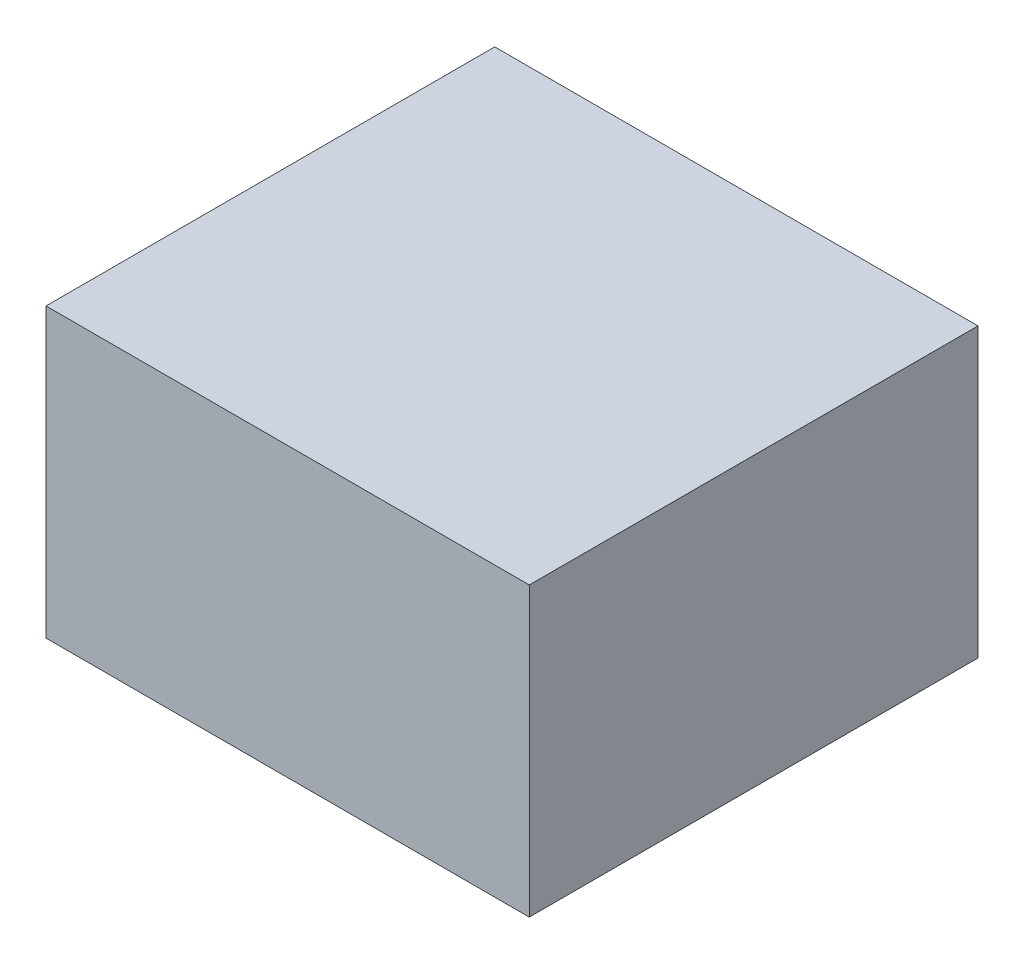
ISO-10303-21;
HEADER;
FILE_DESCRIPTION(('STEP AP214'),'2;1');
FILE_NAME('part.step','',(''),(''),'','','');
FILE_SCHEMA(('AUTOMOTIVE_DESIGN { 1 0 10303 214 1 1 1 1 }'));
ENDSEC;
DATA;
#1=APPLICATION_CONTEXT('core data for automotive mechanical design processes');
#2=APPLICATION_PROTOCOL_DEFINITION('international standard','automotive_design',2000,#1);
#3=PRODUCT_CONTEXT('',#1,'mechanical');
#4=PRODUCT('Part','Part','',(#3));
#5=PRODUCT_RELATED_PRODUCT_CATEGORY('part','',(#4));
#6=PRODUCT_DEFINITION_FORMATION('','',#4);
#7=PRODUCT_DEFINITION_CONTEXT('part definition',#1,'design');
#8=PRODUCT_DEFINITION('design','',#6,#7);
#9=PRODUCT_DEFINITION_SHAPE('','',#8);
#10=(LENGTH_UNIT() NAMED_UNIT(*) SI_UNIT(.MILLI.,.METRE.));
#11=(NAMED_UNIT(*) PLANE_ANGLE_UNIT() SI_UNIT($,.RADIAN.));
#12=(NAMED_UNIT(*) SI_UNIT($,.STERADIAN.) SOLID_ANGLE_UNIT());
#13=UNCERTAINTY_MEASURE_WITH_UNIT(LENGTH_MEASURE(1.E-05),#10,'distance_accuracy_value','');
#14=(GEOMETRIC_REPRESENTATION_CONTEXT(3) GLOBAL_UNCERTAINTY_ASSIGNED_CONTEXT((#13)) GLOBAL_UNIT_ASSIGNED_CONTEXT((#10,
#11,#12)) REPRESENTATION_CONTEXT('',''));
#15=CARTESIAN_POINT('',(0.,0.,0.));
#16=DIRECTION('',(0.,0.,1.));
#17=DIRECTION('',(1.,0.,0.));
#18=AXIS2_PLACEMENT_3D('',#15,#16,#17);
#19=CARTESIAN_POINT('',(0.,50.,0.));
#20=DIRECTION('',(1.,0.,0.));
#21=DIRECTION('',(0.,0.,-1.));
#22=AXIS2_PLACEMENT_3D('',#19,#20,#21);
#23=PLANE('',#22);
#24=DIRECTION('',(0.,0.,1.));
#25=VECTOR('',#24,1.);
#26=CARTESIAN_POINT('',(0.,0.,0.));
#27=LINE('',#26,#25);
#28=CARTESIAN_POINT('',(0.,0.,-78.));
#29=VERTEX_POINT('',#28);
#30=CARTESIAN_POINT('',(0.,0.,0.));
#31=VERTEX_POINT('',#30);
#32=EDGE_CURVE('E101',#29,#31,#27,.T.);
#33=ORIENTED_EDGE('',*,*,#32,.T.);
#34=DIRECTION('',(0.,-1.,0.));
#35=VECTOR('',#34,1.);
#36=CARTESIAN_POINT('',(0.,50.,0.));
#37=LINE('',#36,#35);
#38=CARTESIAN_POINT('',(0.,50.,0.));
#39=VERTEX_POINT('',#38);
#40=EDGE_CURVE('E11',#39,#31,#37,.T.);
#41=ORIENTED_EDGE('',*,*,#40,.F.);
#42=DIRECTION('',(0.,0.,1.));
#43=VECTOR('',#42,1.);
#44=CARTESIAN_POINT('',(0.,50.,0.));
#45=LINE('',#44,#43);
#46=CARTESIAN_POINT('',(0.,50.,-78.));
#47=VERTEX_POINT('',#46);
#48=EDGE_CURVE('E89',#47,#39,#45,.T.);
#49=ORIENTED_EDGE('',*,*,#48,.F.);
#50=DIRECTION('',(0.,-1.,0.));
#51=VECTOR('',#50,1.);
#52=CARTESIAN_POINT('',(0.,50.,-78.));
#53=LINE('',#52,#51);
#54=EDGE_CURVE('E97',#47,#29,#53,.T.);
#55=ORIENTED_EDGE('',*,*,#54,.T.);
#56=EDGE_LOOP('',(#33,#41,#49,#55));
#57=FACE_BOUND('',#56,.T.);
#58=ADVANCED_FACE('F38',(#57),#23,.F.);
#59=CARTESIAN_POINT('',(0.,50.,0.));
#60=DIRECTION('',(0.,0.,-1.));
#61=DIRECTION('',(-1.,0.,0.));
#62=AXIS2_PLACEMENT_3D('',#59,#60,#61);
#63=PLANE('',#62);
#64=DIRECTION('',(1.,0.,0.));
#65=VECTOR('',#64,1.);
#66=CARTESIAN_POINT('',(0.,0.,0.));
#67=LINE('',#66,#65);
#68=CARTESIAN_POINT('',(84.,0.,0.));
#69=VERTEX_POINT('',#68);
#70=EDGE_CURVE('E93',#31,#69,#67,.T.);
#71=ORIENTED_EDGE('',*,*,#70,.T.);
#72=DIRECTION('',(0.,-1.,0.));
#73=VECTOR('',#72,1.);
#74=CARTESIAN_POINT('',(84.,50.,0.));
#75=LINE('',#74,#73);
#76=CARTESIAN_POINT('',(84.,50.,0.));
#77=VERTEX_POINT('',#76);
#78=EDGE_CURVE('E46',#77,#69,#75,.T.);
#79=ORIENTED_EDGE('',*,*,#78,.F.);
#80=DIRECTION('',(1.,0.,0.));
#81=VECTOR('',#80,1.);
#82=CARTESIAN_POINT('',(0.,50.,0.));
#83=LINE('',#82,#81);
#84=EDGE_CURVE('E84',#39,#77,#83,.T.);
#85=ORIENTED_EDGE('',*,*,#84,.F.);
#86=ORIENTED_EDGE('',*,*,#40,.T.);
#87=EDGE_LOOP('',(#71,#79,#85,#86));
#88=FACE_BOUND('',#87,.T.);
#89=ADVANCED_FACE('F92',(#88),#63,.F.);
#90=CARTESIAN_POINT('',(84.,50.,0.));
#91=DIRECTION('',(-1.,0.,0.));
#92=DIRECTION('',(0.,0.,1.));
#93=AXIS2_PLACEMENT_3D('',#90,#91,#92);
#94=PLANE('',#93);
#95=DIRECTION('',(0.,0.,-1.));
#96=VECTOR('',#95,1.);
#97=CARTESIAN_POINT('',(84.,0.,0.));
#98=LINE('',#97,#96);
#99=CARTESIAN_POINT('',(84.,0.,-78.));
#100=VERTEX_POINT('',#99);
#101=EDGE_CURVE('E71',#69,#100,#98,.T.);
#102=ORIENTED_EDGE('',*,*,#101,.T.);
#103=DIRECTION('',(0.,-1.,0.));
#104=VECTOR('',#103,1.);
#105=CARTESIAN_POINT('',(84.,50.,-78.));
#106=LINE('',#105,#104);
#107=CARTESIAN_POINT('',(84.,50.,-78.));
#108=VERTEX_POINT('',#107);
#109=EDGE_CURVE('E94',#108,#100,#106,.T.);
#110=ORIENTED_EDGE('',*,*,#109,.F.);
#111=DIRECTION('',(0.,0.,-1.));
#112=VECTOR('',#111,1.);
#113=CARTESIAN_POINT('',(84.,50.,0.));
#114=LINE('',#113,#112);
#115=EDGE_CURVE('E87',#77,#108,#114,.T.);
#116=ORIENTED_EDGE('',*,*,#115,.F.);
#117=ORIENTED_EDGE('',*,*,#78,.T.);
#118=EDGE_LOOP('',(#102,#110,#116,#117));
#119=FACE_BOUND('',#118,.T.);
#120=ADVANCED_FACE('F95',(#119),#94,.F.);
#121=CARTESIAN_POINT('',(0.,50.,-78.));
#122=DIRECTION('',(0.,0.,1.));
#123=DIRECTION('',(1.,0.,0.));
#124=AXIS2_PLACEMENT_3D('',#121,#122,#123);
#125=PLANE('',#124);
#126=DIRECTION('',(-1.,0.,0.));
#127=VECTOR('',#126,1.);
#128=CARTESIAN_POINT('',(0.,0.,-78.));
#129=LINE('',#128,#127);
#130=EDGE_CURVE('E77',#100,#29,#129,.T.);
#131=ORIENTED_EDGE('',*,*,#130,.T.);
#132=ORIENTED_EDGE('',*,*,#54,.F.);
#133=DIRECTION('',(-1.,0.,0.));
#134=VECTOR('',#133,1.);
#135=CARTESIAN_POINT('',(0.,50.,-78.));
#136=LINE('',#135,#134);
#137=EDGE_CURVE('E54',#108,#47,#136,.T.);
#138=ORIENTED_EDGE('',*,*,#137,.F.);
#139=ORIENTED_EDGE('',*,*,#109,.T.);
#140=EDGE_LOOP('',(#131,#132,#138,#139));
#141=FACE_BOUND('',#140,.T.);
#142=ADVANCED_FACE('F108',(#141),#125,.F.);
#143=CARTESIAN_POINT('',(0.,50.,0.));
#144=DIRECTION('',(0.,-1.,0.));
#145=DIRECTION('',(0.,0.,-1.));
#146=AXIS2_PLACEMENT_3D('',#143,#144,#145);
#147=PLANE('',#146);
#148=ORIENTED_EDGE('',*,*,#48,.T.);
#149=ORIENTED_EDGE('',*,*,#84,.T.);
#150=ORIENTED_EDGE('',*,*,#115,.T.);
#151=ORIENTED_EDGE('',*,*,#137,.T.);
#152=EDGE_LOOP('',(#148,#149,#150,#151));
#153=FACE_BOUND('',#152,.T.);
#154=ADVANCED_FACE('F85',(#153),#147,.F.);
#155=CARTESIAN_POINT('',(0.,0.,0.));
#156=DIRECTION('',(0.,-1.,0.));
#157=DIRECTION('',(0.,0.,-1.));
#158=AXIS2_PLACEMENT_3D('',#155,#156,#157);
#159=PLANE('',#158);
#160=ORIENTED_EDGE('',*,*,#32,.F.);
#161=ORIENTED_EDGE('',*,*,#130,.F.);
#162=ORIENTED_EDGE('',*,*,#101,.F.);
#163=ORIENTED_EDGE('',*,*,#70,.F.);
#164=EDGE_LOOP('',(#160,#161,#162,#163));
#165=FACE_BOUND('',#164,.T.);
#166=ADVANCED_FACE('F111',(#165),#159,.T.);
#167=CLOSED_SHELL('',(#58,#89,#120,#142,#154,#166));
#168=MANIFOLD_SOLID_BREP('B2',#167);
#169=ADVANCED_BREP_SHAPE_REPRESENTATION('',(#18,#168),#14);
#170=SHAPE_DEFINITION_REPRESENTATION(#9,#169);
ENDSEC;
END-ISO-10303-21;
